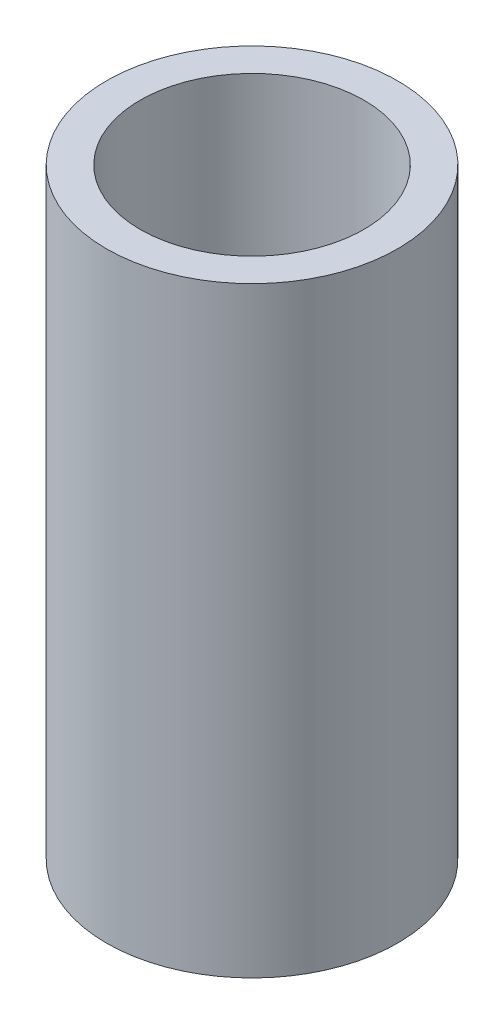
ISO-10303-21;
HEADER;
FILE_DESCRIPTION(('STEP AP214'),'2;1');
FILE_NAME('part.step','',(''),(''),'','','');
FILE_SCHEMA(('AUTOMOTIVE_DESIGN { 1 0 10303 214 1 1 1 1 }'));
ENDSEC;
DATA;
#1=APPLICATION_CONTEXT('core data for automotive mechanical design processes');
#2=APPLICATION_PROTOCOL_DEFINITION('international standard','automotive_design',2000,#1);
#3=PRODUCT_CONTEXT('',#1,'mechanical');
#4=PRODUCT('Part','Part','',(#3));
#5=PRODUCT_RELATED_PRODUCT_CATEGORY('part','',(#4));
#6=PRODUCT_DEFINITION_FORMATION('','',#4);
#7=PRODUCT_DEFINITION_CONTEXT('part definition',#1,'design');
#8=PRODUCT_DEFINITION('design','',#6,#7);
#9=PRODUCT_DEFINITION_SHAPE('','',#8);
#10=(LENGTH_UNIT() NAMED_UNIT(*) SI_UNIT(.MILLI.,.METRE.));
#11=(NAMED_UNIT(*) PLANE_ANGLE_UNIT() SI_UNIT($,.RADIAN.));
#12=(NAMED_UNIT(*) SI_UNIT($,.STERADIAN.) SOLID_ANGLE_UNIT());
#13=UNCERTAINTY_MEASURE_WITH_UNIT(LENGTH_MEASURE(1.E-05),#10,'distance_accuracy_value','');
#14=(GEOMETRIC_REPRESENTATION_CONTEXT(3) GLOBAL_UNCERTAINTY_ASSIGNED_CONTEXT((#13)) GLOBAL_UNIT_ASSIGNED_CONTEXT((#10,
#11,#12)) REPRESENTATION_CONTEXT('',''));
#15=CARTESIAN_POINT('',(0.,0.,0.));
#16=DIRECTION('',(0.,0.,1.));
#17=DIRECTION('',(1.,0.,0.));
#18=AXIS2_PLACEMENT_3D('',#15,#16,#17);
#19=CARTESIAN_POINT('',(0.,61.959306040878,0.));
#20=DIRECTION('',(0.,-1.,0.));
#21=DIRECTION('',(0.,0.,-1.));
#22=AXIS2_PLACEMENT_3D('',#19,#20,#21);
#23=CYLINDRICAL_SURFACE('',#22,15.);
#24=CARTESIAN_POINT('',(0.,61.959306040878,0.));
#25=DIRECTION('',(0.,1.,0.));
#26=DIRECTION('',(0.,0.,1.));
#27=AXIS2_PLACEMENT_3D('',#24,#25,#26);
#28=CIRCLE('',#27,15.);
#29=CARTESIAN_POINT('',(0.,61.959306040878,15.));
#30=VERTEX_POINT('',#29);
#31=EDGE_CURVE('E10',#30,#30,#28,.T.);
#32=ORIENTED_EDGE('',*,*,#31,.F.);
#33=EDGE_LOOP('',(#32));
#34=FACE_BOUND('',#33,.T.);
#35=CARTESIAN_POINT('',(0.,0.,0.));
#36=DIRECTION('',(0.,1.,0.));
#37=DIRECTION('',(0.,0.,1.));
#38=AXIS2_PLACEMENT_3D('',#35,#36,#37);
#39=CIRCLE('',#38,15.);
#40=CARTESIAN_POINT('',(0.,0.,15.));
#41=VERTEX_POINT('',#40);
#42=EDGE_CURVE('E37',#41,#41,#39,.T.);
#43=ORIENTED_EDGE('',*,*,#42,.T.);
#44=EDGE_LOOP('',(#43));
#45=FACE_BOUND('',#44,.T.);
#46=ADVANCED_FACE('F40',(#34,#45),#23,.T.);
#47=CARTESIAN_POINT('',(0.,61.959306040878,0.));
#48=DIRECTION('',(0.,1.,0.));
#49=DIRECTION('',(0.,0.,1.));
#50=AXIS2_PLACEMENT_3D('',#47,#48,#49);
#51=PLANE('',#50);
#52=CARTESIAN_POINT('',(0.,61.959306040878,0.));
#53=DIRECTION('',(0.,1.,0.));
#54=DIRECTION('',(0.,0.,1.));
#55=AXIS2_PLACEMENT_3D('',#52,#53,#54);
#56=CIRCLE('',#55,11.5357649609725);
#57=CARTESIAN_POINT('',(0.,61.959306040878,11.5357649609725));
#58=VERTEX_POINT('',#57);
#59=EDGE_CURVE('E50',#58,#58,#56,.T.);
#60=ORIENTED_EDGE('',*,*,#59,.F.);
#61=EDGE_LOOP('',(#60));
#62=FACE_BOUND('',#61,.T.);
#63=ORIENTED_EDGE('',*,*,#31,.T.);
#64=EDGE_LOOP('',(#63));
#65=FACE_BOUND('',#64,.T.);
#66=ADVANCED_FACE('F59',(#62,#65),#51,.T.);
#67=CARTESIAN_POINT('',(0.,0.,0.));
#68=DIRECTION('',(0.,1.,0.));
#69=DIRECTION('',(0.,0.,1.));
#70=AXIS2_PLACEMENT_3D('',#67,#68,#69);
#71=PLANE('',#70);
#72=CARTESIAN_POINT('',(0.,0.,0.));
#73=DIRECTION('',(0.,1.,0.));
#74=DIRECTION('',(0.,0.,1.));
#75=AXIS2_PLACEMENT_3D('',#72,#73,#74);
#76=CIRCLE('',#75,11.5357649609725);
#77=CARTESIAN_POINT('',(0.,0.,11.5357649609725));
#78=VERTEX_POINT('',#77);
#79=EDGE_CURVE('E47',#78,#78,#76,.T.);
#80=ORIENTED_EDGE('',*,*,#79,.T.);
#81=EDGE_LOOP('',(#80));
#82=FACE_BOUND('',#81,.T.);
#83=ORIENTED_EDGE('',*,*,#42,.F.);
#84=EDGE_LOOP('',(#83));
#85=FACE_BOUND('',#84,.T.);
#86=ADVANCED_FACE('F58',(#82,#85),#71,.F.);
#87=CARTESIAN_POINT('',(0.,61.959306040878,0.));
#88=DIRECTION('',(0.,-1.,0.));
#89=DIRECTION('',(0.,0.,-1.));
#90=AXIS2_PLACEMENT_3D('',#87,#88,#89);
#91=CYLINDRICAL_SURFACE('',#90,11.5357649609725);
#92=ORIENTED_EDGE('',*,*,#59,.T.);
#93=EDGE_LOOP('',(#92));
#94=FACE_BOUND('',#93,.T.);
#95=ORIENTED_EDGE('',*,*,#79,.F.);
#96=EDGE_LOOP('',(#95));
#97=FACE_BOUND('',#96,.T.);
#98=ADVANCED_FACE('F54',(#94,#97),#91,.F.);
#99=CLOSED_SHELL('',(#46,#66,#86,#98));
#100=MANIFOLD_SOLID_BREP('B2',#99);
#101=ADVANCED_BREP_SHAPE_REPRESENTATION('',(#18,#100),#14);
#102=SHAPE_DEFINITION_REPRESENTATION(#9,#101);
ENDSEC;
END-ISO-10303-21;
